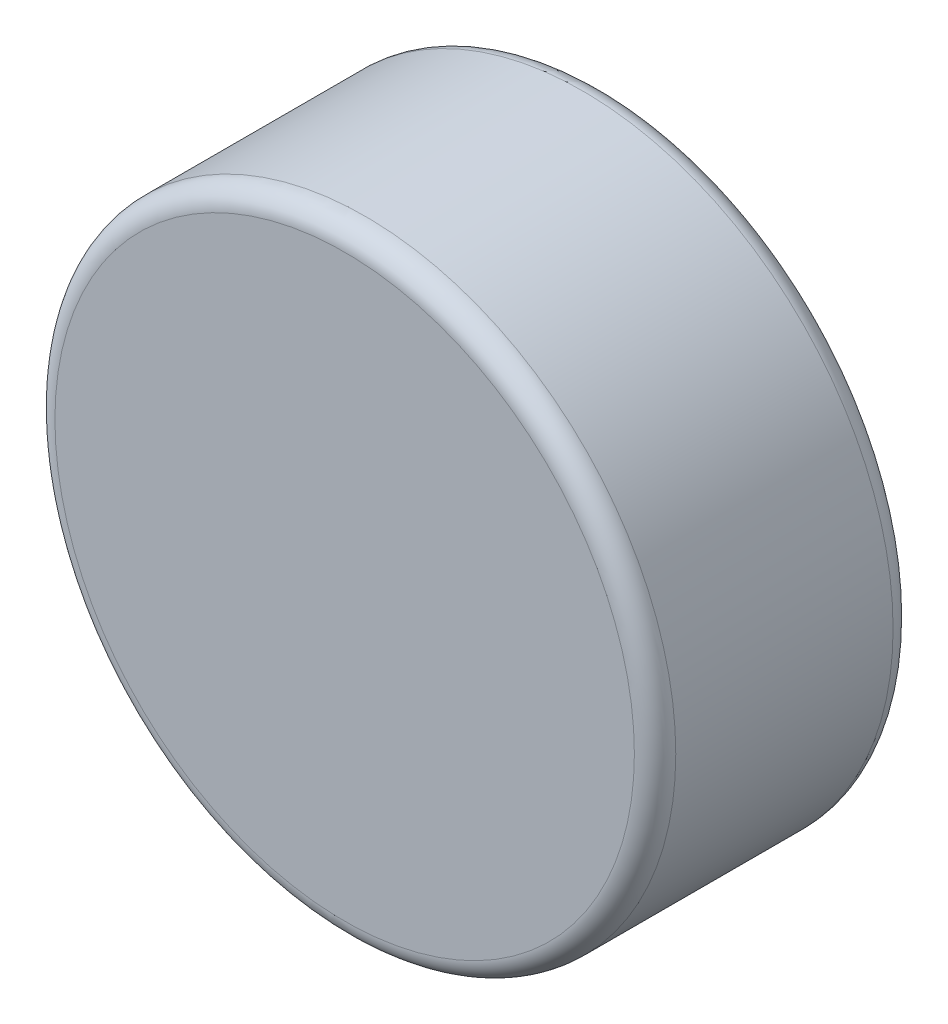
ISO-10303-21;
HEADER;
FILE_DESCRIPTION(('STEP AP214'),'2;1');
FILE_NAME('part.step','',(''),(''),'','','');
FILE_SCHEMA(('AUTOMOTIVE_DESIGN { 1 0 10303 214 1 1 1 1 }'));
ENDSEC;
DATA;
#1=APPLICATION_CONTEXT('core data for automotive mechanical design processes');
#2=APPLICATION_PROTOCOL_DEFINITION('international standard','automotive_design',2000,#1);
#3=PRODUCT_CONTEXT('',#1,'mechanical');
#4=PRODUCT('Part','Part','',(#3));
#5=PRODUCT_RELATED_PRODUCT_CATEGORY('part','',(#4));
#6=PRODUCT_DEFINITION_FORMATION('','',#4);
#7=PRODUCT_DEFINITION_CONTEXT('part definition',#1,'design');
#8=PRODUCT_DEFINITION('design','',#6,#7);
#9=PRODUCT_DEFINITION_SHAPE('','',#8);
#10=(LENGTH_UNIT() NAMED_UNIT(*) SI_UNIT(.MILLI.,.METRE.));
#11=(NAMED_UNIT(*) PLANE_ANGLE_UNIT() SI_UNIT($,.RADIAN.));
#12=(NAMED_UNIT(*) SI_UNIT($,.STERADIAN.) SOLID_ANGLE_UNIT());
#13=UNCERTAINTY_MEASURE_WITH_UNIT(LENGTH_MEASURE(1.E-05),#10,'distance_accuracy_value','');
#14=(GEOMETRIC_REPRESENTATION_CONTEXT(3) GLOBAL_UNCERTAINTY_ASSIGNED_CONTEXT((#13)) GLOBAL_UNIT_ASSIGNED_CONTEXT((#10,
#11,#12)) REPRESENTATION_CONTEXT('',''));
#15=CARTESIAN_POINT('',(0.,0.,0.));
#16=DIRECTION('',(0.,0.,1.));
#17=DIRECTION('',(1.,0.,0.));
#18=AXIS2_PLACEMENT_3D('',#15,#16,#17);
#19=CARTESIAN_POINT('',(0.,0.,2.5));
#20=DIRECTION('',(0.,0.,-1.));
#21=DIRECTION('',(-1.,0.,0.));
#22=AXIS2_PLACEMENT_3D('',#19,#20,#21);
#23=CYLINDRICAL_SURFACE('',#22,3.);
#24=CARTESIAN_POINT('',(0.,0.,0.2));
#25=DIRECTION('',(0.,0.,1.));
#26=DIRECTION('',(1.,0.,0.));
#27=AXIS2_PLACEMENT_3D('',#24,#25,#26);
#28=CIRCLE('',#27,3.);
#29=CARTESIAN_POINT('',(3.,0.,0.2));
#30=VERTEX_POINT('',#29);
#31=EDGE_CURVE('E50',#30,#30,#28,.T.);
#32=ORIENTED_EDGE('',*,*,#31,.T.);
#33=EDGE_LOOP('',(#32));
#34=FACE_BOUND('',#33,.T.);
#35=CARTESIAN_POINT('',(0.,0.,2.3));
#36=DIRECTION('',(0.,0.,1.));
#37=DIRECTION('',(1.,0.,0.));
#38=AXIS2_PLACEMENT_3D('',#35,#36,#37);
#39=CIRCLE('',#38,3.);
#40=CARTESIAN_POINT('',(3.,0.,2.3));
#41=VERTEX_POINT('',#40);
#42=EDGE_CURVE('E55',#41,#41,#39,.F.);
#43=ORIENTED_EDGE('',*,*,#42,.T.);
#44=EDGE_LOOP('',(#43));
#45=FACE_BOUND('',#44,.T.);
#46=ADVANCED_FACE('F36',(#34,#45),#23,.T.);
#47=CARTESIAN_POINT('',(0.,0.,2.5));
#48=DIRECTION('',(0.,0.,1.));
#49=DIRECTION('',(1.,0.,0.));
#50=AXIS2_PLACEMENT_3D('',#47,#48,#49);
#51=PLANE('',#50);
#52=CARTESIAN_POINT('',(0.,0.,2.5));
#53=DIRECTION('',(0.,0.,1.));
#54=DIRECTION('',(1.,0.,0.));
#55=AXIS2_PLACEMENT_3D('',#52,#53,#54);
#56=CIRCLE('',#55,2.8);
#57=CARTESIAN_POINT('',(2.8,0.,2.5));
#58=VERTEX_POINT('',#57);
#59=EDGE_CURVE('E10',#58,#58,#56,.T.);
#60=ORIENTED_EDGE('',*,*,#59,.T.);
#61=EDGE_LOOP('',(#60));
#62=FACE_BOUND('',#61,.T.);
#63=ADVANCED_FACE('F71',(#62),#51,.T.);
#64=CARTESIAN_POINT('',(0.,0.,0.));
#65=DIRECTION('',(0.,0.,1.));
#66=DIRECTION('',(1.,0.,0.));
#67=AXIS2_PLACEMENT_3D('',#64,#65,#66);
#68=PLANE('',#67);
#69=CARTESIAN_POINT('',(0.,0.,0.));
#70=DIRECTION('',(0.,0.,1.));
#71=DIRECTION('',(1.,0.,0.));
#72=AXIS2_PLACEMENT_3D('',#69,#70,#71);
#73=CIRCLE('',#72,2.8);
#74=CARTESIAN_POINT('',(2.8,0.,0.));
#75=VERTEX_POINT('',#74);
#76=EDGE_CURVE('E44',#75,#75,#73,.F.);
#77=ORIENTED_EDGE('',*,*,#76,.T.);
#78=EDGE_LOOP('',(#77));
#79=FACE_BOUND('',#78,.T.);
#80=ADVANCED_FACE('F68',(#79),#68,.F.);
#81=CARTESIAN_POINT('',(0.,0.,0.2));
#82=DIRECTION('',(0.,0.,1.));
#83=DIRECTION('',(1.,0.,0.));
#84=AXIS2_PLACEMENT_3D('',#81,#82,#83);
#85=TOROIDAL_SURFACE('',#84,2.8,0.2);
#86=ORIENTED_EDGE('',*,*,#76,.F.);
#87=EDGE_LOOP('',(#86));
#88=FACE_BOUND('',#87,.T.);
#89=ORIENTED_EDGE('',*,*,#31,.F.);
#90=EDGE_LOOP('',(#89));
#91=FACE_BOUND('',#90,.T.);
#92=ADVANCED_FACE('F64',(#88,#91),#85,.T.);
#93=CARTESIAN_POINT('',(0.,0.,2.3));
#94=DIRECTION('',(0.,0.,1.));
#95=DIRECTION('',(1.,0.,0.));
#96=AXIS2_PLACEMENT_3D('',#93,#94,#95);
#97=TOROIDAL_SURFACE('',#96,2.8,0.2);
#98=ORIENTED_EDGE('',*,*,#42,.F.);
#99=EDGE_LOOP('',(#98));
#100=FACE_BOUND('',#99,.T.);
#101=ORIENTED_EDGE('',*,*,#59,.F.);
#102=EDGE_LOOP('',(#101));
#103=FACE_BOUND('',#102,.T.);
#104=ADVANCED_FACE('F38',(#100,#103),#97,.T.);
#105=CLOSED_SHELL('',(#46,#63,#80,#92,#104));
#106=MANIFOLD_SOLID_BREP('B2',#105);
#107=ADVANCED_BREP_SHAPE_REPRESENTATION('',(#18,#106),#14);
#108=SHAPE_DEFINITION_REPRESENTATION(#9,#107);
ENDSEC;
END-ISO-10303-21;
